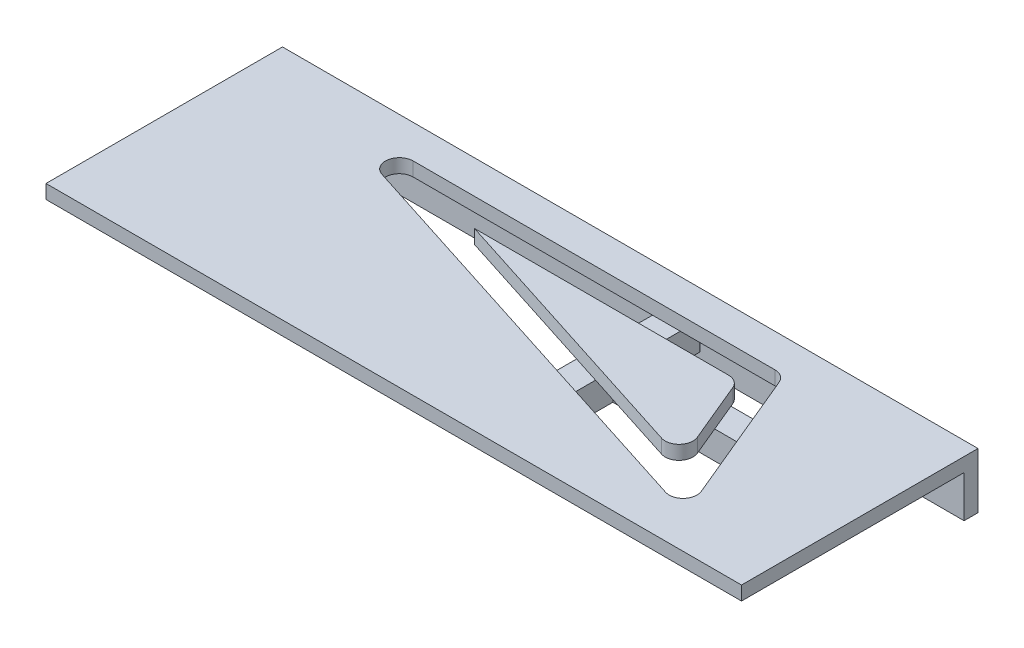
ISO-10303-21;
HEADER;
FILE_DESCRIPTION(('STEP AP214'),'2;1');
FILE_NAME('part.step','',(''),(''),'','','');
FILE_SCHEMA(('AUTOMOTIVE_DESIGN { 1 0 10303 214 1 1 1 1 }'));
ENDSEC;
DATA;
#1=APPLICATION_CONTEXT('core data for automotive mechanical design processes');
#2=APPLICATION_PROTOCOL_DEFINITION('international standard','automotive_design',2000,#1);
#3=PRODUCT_CONTEXT('',#1,'mechanical');
#4=PRODUCT('Part','Part','',(#3));
#5=PRODUCT_RELATED_PRODUCT_CATEGORY('part','',(#4));
#6=PRODUCT_DEFINITION_FORMATION('','',#4);
#7=PRODUCT_DEFINITION_CONTEXT('part definition',#1,'design');
#8=PRODUCT_DEFINITION('design','',#6,#7);
#9=PRODUCT_DEFINITION_SHAPE('','',#8);
#10=(LENGTH_UNIT() NAMED_UNIT(*) SI_UNIT(.MILLI.,.METRE.));
#11=(NAMED_UNIT(*) PLANE_ANGLE_UNIT() SI_UNIT($,.RADIAN.));
#12=(NAMED_UNIT(*) SI_UNIT($,.STERADIAN.) SOLID_ANGLE_UNIT());
#13=UNCERTAINTY_MEASURE_WITH_UNIT(LENGTH_MEASURE(1.E-05),#10,'distance_accuracy_value','');
#14=(GEOMETRIC_REPRESENTATION_CONTEXT(3) GLOBAL_UNCERTAINTY_ASSIGNED_CONTEXT((#13)) GLOBAL_UNIT_ASSIGNED_CONTEXT((#10,
#11,#12)) REPRESENTATION_CONTEXT('',''));
#15=CARTESIAN_POINT('',(0.,0.,0.));
#16=DIRECTION('',(0.,0.,1.));
#17=DIRECTION('',(1.,0.,0.));
#18=AXIS2_PLACEMENT_3D('',#15,#16,#17);
#19=CARTESIAN_POINT('',(0.,15.,85.));
#20=DIRECTION('',(0.,1.,0.));
#21=DIRECTION('',(0.,0.,1.));
#22=AXIS2_PLACEMENT_3D('',#19,#20,#21);
#23=PLANE('',#22);
#24=DIRECTION('',(1.,0.,0.));
#25=VECTOR('',#24,1.);
#26=CARTESIAN_POINT('',(182.333333333333,15.,22.));
#27=LINE('',#26,#25);
#28=CARTESIAN_POINT('',(91.0305059355084,15.,22.));
#29=VERTEX_POINT('',#28);
#30=CARTESIAN_POINT('',(145.,15.,22.));
#31=VERTEX_POINT('',#30);
#32=EDGE_CURVE('E275',#29,#31,#27,.T.);
#33=ORIENTED_EDGE('',*,*,#32,.T.);
#34=DIRECTION('',(0.,0.,-1.));
#35=VECTOR('',#34,1.);
#36=CARTESIAN_POINT('',(145.,15.,31.2449958123108));
#37=LINE('',#36,#35);
#38=CARTESIAN_POINT('',(145.,15.,39.2702381006373));
#39=VERTEX_POINT('',#38);
#40=EDGE_CURVE('E903',#39,#31,#37,.T.);
#41=ORIENTED_EDGE('',*,*,#40,.F.);
#42=DIRECTION('',(-0.952424147199324,0.,-0.304775727103784));
#43=VECTOR('',#42,1.);
#44=CARTESIAN_POINT('',(189.928273384325,15.,53.6472855836212));
#45=LINE('',#44,#43);
#46=EDGE_CURVE('E284',#39,#29,#45,.T.);
#47=ORIENTED_EDGE('',*,*,#46,.T.);
#48=EDGE_LOOP('',(#33,#41,#47));
#49=FACE_BOUND('',#48,.T.);
#50=ADVANCED_FACE('F35',(#49),#23,.F.);
#51=CARTESIAN_POINT('',(189.928273384325,15.,53.6472855836212));
#52=VERTEX_POINT('',#51);
#53=CARTESIAN_POINT('',(155.,15.,42.4702381006373));
#54=VERTEX_POINT('',#53);
#55=EDGE_CURVE('E285',#52,#54,#45,.T.);
#56=ORIENTED_EDGE('',*,*,#55,.T.);
#57=DIRECTION('',(0.,0.,1.));
#58=VECTOR('',#57,1.);
#59=CARTESIAN_POINT('',(155.,15.,36.2449958123108));
#60=LINE('',#59,#58);
#61=CARTESIAN_POINT('',(155.,15.,36.2449958123108));
#62=VERTEX_POINT('',#61);
#63=EDGE_CURVE('E376',#62,#54,#60,.T.);
#64=ORIENTED_EDGE('',*,*,#63,.F.);
#65=DIRECTION('',(-1.,0.,0.));
#66=VECTOR('',#65,1.);
#67=CARTESIAN_POINT('',(155.,15.,36.2449958123108));
#68=LINE('',#67,#66);
#69=CARTESIAN_POINT('',(191.602081588463,15.,36.2449958123108));
#70=VERTEX_POINT('',#69);
#71=EDGE_CURVE('E371',#70,#62,#68,.T.);
#72=ORIENTED_EDGE('',*,*,#71,.F.);
#73=DIRECTION('',(0.384615384615385,0.,0.923076923076923));
#74=VECTOR('',#73,1.);
#75=CARTESIAN_POINT('',(196.067536635228,15.,46.9620879245476));
#76=LINE('',#75,#74);
#77=CARTESIAN_POINT('',(196.067536635228,15.,46.9620879245476));
#78=VERTEX_POINT('',#77);
#79=EDGE_CURVE('E271',#70,#78,#76,.T.);
#80=ORIENTED_EDGE('',*,*,#79,.T.);
#81=CARTESIAN_POINT('',(191.452152019844,15.,48.8851648476246));
#82=DIRECTION('',(0.,-1.,0.));
#83=DIRECTION('',(0.,0.,1.));
#84=AXIS2_PLACEMENT_3D('',#81,#82,#83);
#85=CIRCLE('',#84,5.);
#86=EDGE_CURVE('E269',#78,#52,#85,.T.);
#87=ORIENTED_EDGE('',*,*,#86,.T.);
#88=EDGE_LOOP('',(#56,#64,#72,#80,#87));
#89=FACE_BOUND('',#88,.T.);
#90=ADVANCED_FACE('F582',(#89),#23,.F.);
#91=CARTESIAN_POINT('',(155.,15.,22.));
#92=VERTEX_POINT('',#91);
#93=CARTESIAN_POINT('',(182.333333333333,15.,22.));
#94=VERTEX_POINT('',#93);
#95=EDGE_CURVE('E274',#92,#94,#27,.T.);
#96=ORIENTED_EDGE('',*,*,#95,.T.);
#97=CARTESIAN_POINT('',(182.333333333333,15.,27.));
#98=DIRECTION('',(0.,-1.,0.));
#99=DIRECTION('',(0.,0.,-1.));
#100=AXIS2_PLACEMENT_3D('',#97,#98,#99);
#101=CIRCLE('',#100,4.99999999999999);
#102=CARTESIAN_POINT('',(186.948717948718,15.,25.0769230769231));
#103=VERTEX_POINT('',#102);
#104=EDGE_CURVE('E252',#94,#103,#101,.T.);
#105=ORIENTED_EDGE('',*,*,#104,.T.);
#106=CARTESIAN_POINT('',(187.435414921796,15.,26.2449958123108));
#107=VERTEX_POINT('',#106);
#108=EDGE_CURVE('E262',#103,#107,#76,.T.);
#109=ORIENTED_EDGE('',*,*,#108,.T.);
#110=DIRECTION('',(1.,0.,0.));
#111=VECTOR('',#110,1.);
#112=CARTESIAN_POINT('',(155.,15.,26.2449958123108));
#113=LINE('',#112,#111);
#114=CARTESIAN_POINT('',(155.,15.,26.2449958123108));
#115=VERTEX_POINT('',#114);
#116=EDGE_CURVE('E366',#115,#107,#113,.T.);
#117=ORIENTED_EDGE('',*,*,#116,.F.);
#118=DIRECTION('',(0.,0.,1.));
#119=VECTOR('',#118,1.);
#120=CARTESIAN_POINT('',(155.,15.,26.2449958123108));
#121=LINE('',#120,#119);
#122=EDGE_CURVE('E361',#92,#115,#121,.T.);
#123=ORIENTED_EDGE('',*,*,#122,.F.);
#124=EDGE_LOOP('',(#96,#105,#109,#117,#123));
#125=FACE_BOUND('',#124,.T.);
#126=ADVANCED_FACE('F272',(#125),#23,.F.);
#127=CARTESIAN_POINT('',(0.,0.,5.));
#128=DIRECTION('',(0.,0.,-1.));
#129=DIRECTION('',(-1.,0.,0.));
#130=AXIS2_PLACEMENT_3D('',#127,#128,#129);
#131=PLANE('',#130);
#132=DIRECTION('',(0.,1.,0.));
#133=VECTOR('',#132,1.);
#134=CARTESIAN_POINT('',(145.003192306434,5.,5.));
#135=LINE('',#134,#133);
#136=CARTESIAN_POINT('',(145.003192306434,15.,5.));
#137=VERTEX_POINT('',#136);
#138=CARTESIAN_POINT('',(145.003192306434,5.,5.));
#139=VERTEX_POINT('',#138);
#140=EDGE_CURVE('E412',#137,#139,#135,.F.);
#141=ORIENTED_EDGE('',*,*,#140,.F.);
#142=DIRECTION('',(1.,0.,0.));
#143=VECTOR('',#142,1.);
#144=CARTESIAN_POINT('',(0.,15.,5.));
#145=LINE('',#144,#143);
#146=CARTESIAN_POINT('',(0.,15.,5.));
#147=VERTEX_POINT('',#146);
#148=EDGE_CURVE('E420',#147,#137,#145,.T.);
#149=ORIENTED_EDGE('',*,*,#148,.F.);
#150=DIRECTION('',(0.,-1.,0.));
#151=VECTOR('',#150,1.);
#152=CARTESIAN_POINT('',(0.,0.,5.));
#153=LINE('',#152,#151);
#154=CARTESIAN_POINT('',(0.,0.,5.));
#155=VERTEX_POINT('',#154);
#156=EDGE_CURVE('E437',#147,#155,#153,.T.);
#157=ORIENTED_EDGE('',*,*,#156,.T.);
#158=DIRECTION('',(1.,0.,0.));
#159=VECTOR('',#158,1.);
#160=CARTESIAN_POINT('',(0.,0.,5.));
#161=LINE('',#160,#159);
#162=CARTESIAN_POINT('',(250.,0.,5.));
#163=VERTEX_POINT('',#162);
#164=EDGE_CURVE('E439',#155,#163,#161,.T.);
#165=ORIENTED_EDGE('',*,*,#164,.T.);
#166=DIRECTION('',(0.,1.,0.));
#167=VECTOR('',#166,1.);
#168=CARTESIAN_POINT('',(250.,0.,5.));
#169=LINE('',#168,#167);
#170=CARTESIAN_POINT('',(250.,15.,5.));
#171=VERTEX_POINT('',#170);
#172=EDGE_CURVE('E442',#163,#171,#169,.T.);
#173=ORIENTED_EDGE('',*,*,#172,.T.);
#174=CARTESIAN_POINT('',(154.996807693566,15.,5.));
#175=VERTEX_POINT('',#174);
#176=EDGE_CURVE('E415',#175,#171,#145,.T.);
#177=ORIENTED_EDGE('',*,*,#176,.F.);
#178=DIRECTION('',(0.,1.,0.));
#179=VECTOR('',#178,1.);
#180=CARTESIAN_POINT('',(154.996807693566,5.,5.));
#181=LINE('',#180,#179);
#182=CARTESIAN_POINT('',(154.996807693566,5.,5.));
#183=VERTEX_POINT('',#182);
#184=EDGE_CURVE('E409',#183,#175,#181,.T.);
#185=ORIENTED_EDGE('',*,*,#184,.F.);
#186=DIRECTION('',(-1.,0.,0.));
#187=VECTOR('',#186,1.);
#188=CARTESIAN_POINT('',(0.,5.,5.));
#189=LINE('',#188,#187);
#190=EDGE_CURVE('E467',#183,#139,#189,.T.);
#191=ORIENTED_EDGE('',*,*,#190,.T.);
#192=EDGE_LOOP('',(#141,#149,#157,#165,#173,#177,#185,#191));
#193=FACE_BOUND('',#192,.T.);
#194=ADVANCED_FACE('F546',(#193),#131,.F.);
#195=CARTESIAN_POINT('',(198.26874825513,15.,26.2449958123108));
#196=VERTEX_POINT('',#195);
#197=CARTESIAN_POINT('',(214.286235524828,15.,26.2449958123108));
#198=VERTEX_POINT('',#197);
#199=EDGE_CURVE('E365',#196,#198,#113,.T.);
#200=ORIENTED_EDGE('',*,*,#199,.F.);
#201=DIRECTION('',(0.384615384615384,0.,0.923076923076923));
#202=VECTOR('',#201,1.);
#203=CARTESIAN_POINT('',(213.615384615385,15.,63.076923076923));
#204=LINE('',#203,#202);
#205=CARTESIAN_POINT('',(193.615384615385,15.,15.0769230769231));
#206=VERTEX_POINT('',#205);
#207=EDGE_CURVE('E314',#206,#196,#204,.T.);
#208=ORIENTED_EDGE('',*,*,#207,.F.);
#209=CARTESIAN_POINT('',(189.,15.,17.));
#210=DIRECTION('',(0.,-1.,0.));
#211=DIRECTION('',(0.,0.,-1.));
#212=AXIS2_PLACEMENT_3D('',#209,#210,#211);
#213=CIRCLE('',#212,5.);
#214=CARTESIAN_POINT('',(189.,15.,12.));
#215=VERTEX_POINT('',#214);
#216=EDGE_CURVE('E309',#215,#206,#213,.T.);
#217=ORIENTED_EDGE('',*,*,#216,.F.);
#218=DIRECTION('',(1.,0.,0.));
#219=VECTOR('',#218,1.);
#220=CARTESIAN_POINT('',(189.,15.,12.));
#221=LINE('',#220,#219);
#222=CARTESIAN_POINT('',(155.,15.,12.));
#223=VERTEX_POINT('',#222);
#224=EDGE_CURVE('E305',#223,#215,#221,.T.);
#225=ORIENTED_EDGE('',*,*,#224,.F.);
#226=CARTESIAN_POINT('',(155.,15.,5.17864174628777));
#227=VERTEX_POINT('',#226);
#228=EDGE_CURVE('E362',#227,#223,#121,.T.);
#229=ORIENTED_EDGE('',*,*,#228,.F.);
#230=CARTESIAN_POINT('',(150.,15.,5.17864174628777));
#231=DIRECTION('',(0.,1.,0.));
#232=DIRECTION('',(0.,0.,1.));
#233=AXIS2_PLACEMENT_3D('',#230,#231,#232);
#234=CIRCLE('',#233,5.);
#235=EDGE_CURVE('E464',#175,#227,#234,.F.);
#236=ORIENTED_EDGE('',*,*,#235,.F.);
#237=ORIENTED_EDGE('',*,*,#176,.T.);
#238=DIRECTION('',(0.,0.,-1.));
#239=VECTOR('',#238,1.);
#240=CARTESIAN_POINT('',(250.,15.,85.));
#241=LINE('',#240,#239);
#242=CARTESIAN_POINT('',(250.,15.,85.));
#243=VERTEX_POINT('',#242);
#244=EDGE_CURVE('E428',#243,#171,#241,.T.);
#245=ORIENTED_EDGE('',*,*,#244,.F.);
#246=DIRECTION('',(1.,0.,0.));
#247=VECTOR('',#246,1.);
#248=CARTESIAN_POINT('',(0.,15.,85.));
#249=LINE('',#248,#247);
#250=CARTESIAN_POINT('',(0.,15.,85.));
#251=VERTEX_POINT('',#250);
#252=EDGE_CURVE('E419',#251,#243,#249,.T.);
#253=ORIENTED_EDGE('',*,*,#252,.F.);
#254=DIRECTION('',(0.,0.,-1.));
#255=VECTOR('',#254,1.);
#256=CARTESIAN_POINT('',(0.,15.,85.));
#257=LINE('',#256,#255);
#258=EDGE_CURVE('E433',#251,#147,#257,.T.);
#259=ORIENTED_EDGE('',*,*,#258,.T.);
#260=ORIENTED_EDGE('',*,*,#148,.T.);
#261=CARTESIAN_POINT('',(150.,15.,5.17864174628777));
#262=DIRECTION('',(0.,-1.,0.));
#263=DIRECTION('',(0.,0.,-1.));
#264=AXIS2_PLACEMENT_3D('',#261,#262,#263);
#265=CIRCLE('',#264,5.);
#266=CARTESIAN_POINT('',(145.,15.,5.17864174628777));
#267=VERTEX_POINT('',#266);
#268=EDGE_CURVE('E336',#267,#137,#265,.T.);
#269=ORIENTED_EDGE('',*,*,#268,.F.);
#270=CARTESIAN_POINT('',(145.,15.,12.));
#271=VERTEX_POINT('',#270);
#272=EDGE_CURVE('E382',#271,#267,#37,.T.);
#273=ORIENTED_EDGE('',*,*,#272,.F.);
#274=CARTESIAN_POINT('',(59.0000000000008,15.,12.));
#275=VERTEX_POINT('',#274);
#276=EDGE_CURVE('E306',#275,#271,#221,.T.);
#277=ORIENTED_EDGE('',*,*,#276,.F.);
#278=CARTESIAN_POINT('',(59.0000000000001,15.,17.));
#279=DIRECTION('',(0.,-1.,0.));
#280=DIRECTION('',(0.,0.,-1.));
#281=AXIS2_PLACEMENT_3D('',#278,#279,#280);
#282=CIRCLE('',#281,5.);
#283=CARTESIAN_POINT('',(57.4761213644818,15.,21.7621207359969));
#284=VERTEX_POINT('',#283);
#285=EDGE_CURVE('E301',#284,#275,#282,.T.);
#286=ORIENTED_EDGE('',*,*,#285,.F.);
#287=DIRECTION('',(-0.952424147199324,0.,-0.304775727103784));
#288=VECTOR('',#287,1.);
#289=CARTESIAN_POINT('',(207.476121364481,15.,69.7621207359966));
#290=LINE('',#289,#288);
#291=CARTESIAN_POINT('',(145.,15.,49.7697618993627));
#292=VERTEX_POINT('',#291);
#293=EDGE_CURVE('E298',#292,#284,#290,.T.);
#294=ORIENTED_EDGE('',*,*,#293,.F.);
#295=CARTESIAN_POINT('',(145.,15.,65.7198511899543));
#296=VERTEX_POINT('',#295);
#297=EDGE_CURVE('E341',#296,#292,#37,.T.);
#298=ORIENTED_EDGE('',*,*,#297,.F.);
#299=CARTESIAN_POINT('',(150.,15.,65.7198511899543));
#300=DIRECTION('',(0.,-1.,0.));
#301=DIRECTION('',(0.,0.,-1.));
#302=AXIS2_PLACEMENT_3D('',#299,#300,#301);
#303=CIRCLE('',#302,4.99999999999994);
#304=CARTESIAN_POINT('',(155.,15.,65.7198511899543));
#305=VERTEX_POINT('',#304);
#306=EDGE_CURVE('E379',#305,#296,#303,.T.);
#307=ORIENTED_EDGE('',*,*,#306,.F.);
#308=CARTESIAN_POINT('',(155.,15.,52.9697618993626));
#309=VERTEX_POINT('',#308);
#310=EDGE_CURVE('E375',#309,#305,#60,.T.);
#311=ORIENTED_EDGE('',*,*,#310,.F.);
#312=CARTESIAN_POINT('',(207.476121364481,15.,69.7621207359966));
#313=VERTEX_POINT('',#312);
#314=EDGE_CURVE('E299',#313,#309,#290,.T.);
#315=ORIENTED_EDGE('',*,*,#314,.F.);
#316=CARTESIAN_POINT('',(209.,15.,65.));
#317=DIRECTION('',(0.,-1.,0.));
#318=DIRECTION('',(0.,0.,1.));
#319=AXIS2_PLACEMENT_3D('',#316,#317,#318);
#320=CIRCLE('',#319,5.);
#321=CARTESIAN_POINT('',(213.615384615385,15.,63.076923076923));
#322=VERTEX_POINT('',#321);
#323=EDGE_CURVE('E291',#322,#313,#320,.T.);
#324=ORIENTED_EDGE('',*,*,#323,.F.);
#325=CARTESIAN_POINT('',(202.435414921796,15.,36.2449958123108));
#326=VERTEX_POINT('',#325);
#327=EDGE_CURVE('E313',#326,#322,#204,.T.);
#328=ORIENTED_EDGE('',*,*,#327,.F.);
#329=CARTESIAN_POINT('',(214.286235524828,15.,36.2449958123108));
#330=VERTEX_POINT('',#329);
#331=EDGE_CURVE('E372',#330,#326,#68,.T.);
#332=ORIENTED_EDGE('',*,*,#331,.F.);
#333=CARTESIAN_POINT('',(214.286235524828,15.,31.2449958123108));
#334=DIRECTION('',(0.,-1.,0.));
#335=DIRECTION('',(0.,0.,-1.));
#336=AXIS2_PLACEMENT_3D('',#333,#334,#335);
#337=CIRCLE('',#336,5.);
#338=EDGE_CURVE('E368',#198,#330,#337,.T.);
#339=ORIENTED_EDGE('',*,*,#338,.F.);
#340=EDGE_LOOP('',(#200,#208,#217,#225,#229,#236,#237,#245,#253,#259,#260,#269,#273,#277,#286,
#294,#298,#307,#311,#315,#324,#328,#332,#339));
#341=FACE_BOUND('',#340,.T.);
#342=ADVANCED_FACE('F507',(#341),#23,.F.);
#343=CARTESIAN_POINT('',(0.,0.,5.));
#344=DIRECTION('',(1.,0.,0.));
#345=DIRECTION('',(0.,0.,-1.));
#346=AXIS2_PLACEMENT_3D('',#343,#344,#345);
#347=PLANE('',#346);
#348=DIRECTION('',(0.,-1.,0.));
#349=VECTOR('',#348,1.);
#350=CARTESIAN_POINT('',(0.,0.,0.));
#351=LINE('',#350,#349);
#352=CARTESIAN_POINT('',(0.,20.,0.));
#353=VERTEX_POINT('',#352);
#354=CARTESIAN_POINT('',(0.,0.,0.));
#355=VERTEX_POINT('',#354);
#356=EDGE_CURVE('E436',#353,#355,#351,.T.);
#357=ORIENTED_EDGE('',*,*,#356,.T.);
#358=DIRECTION('',(0.,0.,-1.));
#359=VECTOR('',#358,1.);
#360=CARTESIAN_POINT('',(0.,0.,5.));
#361=LINE('',#360,#359);
#362=EDGE_CURVE('E461',#155,#355,#361,.T.);
#363=ORIENTED_EDGE('',*,*,#362,.F.);
#364=ORIENTED_EDGE('',*,*,#156,.F.);
#365=ORIENTED_EDGE('',*,*,#258,.F.);
#366=DIRECTION('',(0.,-1.,0.));
#367=VECTOR('',#366,1.);
#368=CARTESIAN_POINT('',(0.,20.,85.));
#369=LINE('',#368,#367);
#370=CARTESIAN_POINT('',(0.,20.,85.));
#371=VERTEX_POINT('',#370);
#372=EDGE_CURVE('E416',#371,#251,#369,.T.);
#373=ORIENTED_EDGE('',*,*,#372,.F.);
#374=DIRECTION('',(0.,0.,-1.));
#375=VECTOR('',#374,1.);
#376=CARTESIAN_POINT('',(0.,20.,5.));
#377=LINE('',#376,#375);
#378=EDGE_CURVE('E445',#371,#353,#377,.T.);
#379=ORIENTED_EDGE('',*,*,#378,.T.);
#380=EDGE_LOOP('',(#357,#363,#364,#365,#373,#379));
#381=FACE_BOUND('',#380,.T.);
#382=ADVANCED_FACE('F37',(#381),#347,.F.);
#383=CARTESIAN_POINT('',(0.,0.,5.));
#384=DIRECTION('',(0.,1.,0.));
#385=DIRECTION('',(0.,0.,1.));
#386=AXIS2_PLACEMENT_3D('',#383,#384,#385);
#387=PLANE('',#386);
#388=DIRECTION('',(1.,0.,0.));
#389=VECTOR('',#388,1.);
#390=CARTESIAN_POINT('',(0.,0.,0.));
#391=LINE('',#390,#389);
#392=CARTESIAN_POINT('',(250.,0.,0.));
#393=VERTEX_POINT('',#392);
#394=EDGE_CURVE('E448',#355,#393,#391,.T.);
#395=ORIENTED_EDGE('',*,*,#394,.T.);
#396=DIRECTION('',(0.,0.,-1.));
#397=VECTOR('',#396,1.);
#398=CARTESIAN_POINT('',(250.,0.,5.));
#399=LINE('',#398,#397);
#400=EDGE_CURVE('E458',#163,#393,#399,.T.);
#401=ORIENTED_EDGE('',*,*,#400,.F.);
#402=ORIENTED_EDGE('',*,*,#164,.F.);
#403=ORIENTED_EDGE('',*,*,#362,.T.);
#404=EDGE_LOOP('',(#395,#401,#402,#403));
#405=FACE_BOUND('',#404,.T.);
#406=ADVANCED_FACE('F563',(#405),#387,.F.);
#407=CARTESIAN_POINT('',(250.,0.,5.));
#408=DIRECTION('',(-1.,0.,0.));
#409=DIRECTION('',(0.,0.,1.));
#410=AXIS2_PLACEMENT_3D('',#407,#408,#409);
#411=PLANE('',#410);
#412=DIRECTION('',(0.,1.,0.));
#413=VECTOR('',#412,1.);
#414=CARTESIAN_POINT('',(250.,0.,0.));
#415=LINE('',#414,#413);
#416=CARTESIAN_POINT('',(250.,20.,0.));
#417=VERTEX_POINT('',#416);
#418=EDGE_CURVE('E450',#393,#417,#415,.T.);
#419=ORIENTED_EDGE('',*,*,#418,.T.);
#420=DIRECTION('',(0.,0.,-1.));
#421=VECTOR('',#420,1.);
#422=CARTESIAN_POINT('',(250.,20.,5.));
#423=LINE('',#422,#421);
#424=CARTESIAN_POINT('',(250.,20.,85.));
#425=VERTEX_POINT('',#424);
#426=EDGE_CURVE('E455',#425,#417,#423,.T.);
#427=ORIENTED_EDGE('',*,*,#426,.F.);
#428=DIRECTION('',(0.,1.,0.));
#429=VECTOR('',#428,1.);
#430=CARTESIAN_POINT('',(250.,20.,85.));
#431=LINE('',#430,#429);
#432=EDGE_CURVE('E422',#243,#425,#431,.T.);
#433=ORIENTED_EDGE('',*,*,#432,.F.);
#434=ORIENTED_EDGE('',*,*,#244,.T.);
#435=ORIENTED_EDGE('',*,*,#172,.F.);
#436=ORIENTED_EDGE('',*,*,#400,.T.);
#437=EDGE_LOOP('',(#419,#427,#433,#434,#435,#436));
#438=FACE_BOUND('',#437,.T.);
#439=ADVANCED_FACE('F553',(#438),#411,.F.);
#440=CARTESIAN_POINT('',(0.,20.,5.));
#441=DIRECTION('',(0.,-1.,0.));
#442=DIRECTION('',(0.,0.,-1.));
#443=AXIS2_PLACEMENT_3D('',#440,#441,#442);
#444=PLANE('',#443);
#445=DIRECTION('',(0.384615384615384,0.,0.923076923076923));
#446=VECTOR('',#445,1.);
#447=CARTESIAN_POINT('',(161.396449704142,20.,-62.2485207100592));
#448=LINE('',#447,#446);
#449=CARTESIAN_POINT('',(193.615384615385,20.,15.0769230769231));
#450=VERTEX_POINT('',#449);
#451=CARTESIAN_POINT('',(213.615384615385,20.,63.076923076923));
#452=VERTEX_POINT('',#451);
#453=EDGE_CURVE('E43',#450,#452,#448,.T.);
#454=ORIENTED_EDGE('',*,*,#453,.T.);
#455=CARTESIAN_POINT('',(209.,20.,65.));
#456=DIRECTION('',(0.,-1.,0.));
#457=DIRECTION('',(0.,0.,-1.));
#458=AXIS2_PLACEMENT_3D('',#455,#456,#457);
#459=CIRCLE('',#458,5.);
#460=CARTESIAN_POINT('',(207.476121364481,20.,69.7621207359966));
#461=VERTEX_POINT('',#460);
#462=EDGE_CURVE('E11',#452,#461,#459,.T.);
#463=ORIENTED_EDGE('',*,*,#462,.T.);
#464=DIRECTION('',(-0.952424147199324,0.,-0.304775727103784));
#465=VECTOR('',#464,1.);
#466=CARTESIAN_POINT('',(0.473218606861348,20.,3.52119185355829));
#467=LINE('',#466,#465);
#468=CARTESIAN_POINT('',(57.4761213644818,20.,21.7621207359968));
#469=VERTEX_POINT('',#468);
#470=EDGE_CURVE('E478',#461,#469,#467,.T.);
#471=ORIENTED_EDGE('',*,*,#470,.T.);
#472=CARTESIAN_POINT('',(59.0000000000001,20.,17.));
#473=DIRECTION('',(0.,-1.,0.));
#474=DIRECTION('',(0.,0.,-1.));
#475=AXIS2_PLACEMENT_3D('',#472,#473,#474);
#476=CIRCLE('',#475,5.);
#477=CARTESIAN_POINT('',(59.0000000000008,20.,12.));
#478=VERTEX_POINT('',#477);
#479=EDGE_CURVE('E481',#469,#478,#476,.T.);
#480=ORIENTED_EDGE('',*,*,#479,.T.);
#481=DIRECTION('',(1.,0.,0.));
#482=VECTOR('',#481,1.);
#483=CARTESIAN_POINT('',(0.,20.,12.));
#484=LINE('',#483,#482);
#485=CARTESIAN_POINT('',(189.,20.,12.));
#486=VERTEX_POINT('',#485);
#487=EDGE_CURVE('E484',#478,#486,#484,.T.);
#488=ORIENTED_EDGE('',*,*,#487,.T.);
#489=CARTESIAN_POINT('',(189.,20.,17.));
#490=DIRECTION('',(0.,-1.,0.));
#491=DIRECTION('',(0.,0.,-1.));
#492=AXIS2_PLACEMENT_3D('',#489,#490,#491);
#493=CIRCLE('',#492,5.);
#494=EDGE_CURVE('E487',#486,#450,#493,.T.);
#495=ORIENTED_EDGE('',*,*,#494,.T.);
#496=EDGE_LOOP('',(#454,#463,#471,#480,#488,#495));
#497=FACE_BOUND('',#496,.T.);
#498=DIRECTION('',(-1.,0.,0.));
#499=VECTOR('',#498,1.);
#500=CARTESIAN_POINT('',(0.,20.,0.));
#501=LINE('',#500,#499);
#502=EDGE_CURVE('E440',#417,#353,#501,.T.);
#503=ORIENTED_EDGE('',*,*,#502,.T.);
#504=ORIENTED_EDGE('',*,*,#378,.F.);
#505=DIRECTION('',(-1.,0.,0.));
#506=VECTOR('',#505,1.);
#507=CARTESIAN_POINT('',(0.,20.,85.));
#508=LINE('',#507,#506);
#509=EDGE_CURVE('E425',#425,#371,#508,.T.);
#510=ORIENTED_EDGE('',*,*,#509,.F.);
#511=ORIENTED_EDGE('',*,*,#426,.T.);
#512=EDGE_LOOP('',(#503,#504,#510,#511));
#513=FACE_BOUND('',#512,.T.);
#514=ADVANCED_FACE('F491',(#497,#513),#444,.F.);
#515=CARTESIAN_POINT('',(0.,0.,0.));
#516=DIRECTION('',(0.,0.,-1.));
#517=DIRECTION('',(-1.,0.,0.));
#518=AXIS2_PLACEMENT_3D('',#515,#516,#517);
#519=PLANE('',#518);
#520=ORIENTED_EDGE('',*,*,#356,.F.);
#521=ORIENTED_EDGE('',*,*,#502,.F.);
#522=ORIENTED_EDGE('',*,*,#418,.F.);
#523=ORIENTED_EDGE('',*,*,#394,.F.);
#524=EDGE_LOOP('',(#520,#521,#522,#523));
#525=FACE_BOUND('',#524,.T.);
#526=ADVANCED_FACE('F568',(#525),#519,.T.);
#527=CARTESIAN_POINT('',(0.,0.,85.));
#528=DIRECTION('',(0.,0.,1.));
#529=DIRECTION('',(1.,0.,0.));
#530=AXIS2_PLACEMENT_3D('',#527,#528,#529);
#531=PLANE('',#530);
#532=ORIENTED_EDGE('',*,*,#372,.T.);
#533=ORIENTED_EDGE('',*,*,#252,.T.);
#534=ORIENTED_EDGE('',*,*,#432,.T.);
#535=ORIENTED_EDGE('',*,*,#509,.T.);
#536=EDGE_LOOP('',(#532,#533,#534,#535));
#537=FACE_BOUND('',#536,.T.);
#538=ADVANCED_FACE('F557',(#537),#531,.T.);
#539=CARTESIAN_POINT('',(150.,5.,5.17864174628777));
#540=DIRECTION('',(0.,-1.,0.));
#541=DIRECTION('',(0.,0.,-1.));
#542=AXIS2_PLACEMENT_3D('',#539,#540,#541);
#543=PLANE('',#542);
#544=ORIENTED_EDGE('',*,*,#190,.F.);
#545=CARTESIAN_POINT('',(150.,5.,5.17864174628777));
#546=DIRECTION('',(0.,-1.,0.));
#547=DIRECTION('',(0.,0.,-1.));
#548=AXIS2_PLACEMENT_3D('',#545,#546,#547);
#549=CIRCLE('',#548,5.);
#550=CARTESIAN_POINT('',(155.,5.,5.17864174628777));
#551=VERTEX_POINT('',#550);
#552=EDGE_CURVE('E340',#183,#551,#549,.T.);
#553=ORIENTED_EDGE('',*,*,#552,.T.);
#554=DIRECTION('',(0.,0.,1.));
#555=VECTOR('',#554,1.);
#556=CARTESIAN_POINT('',(155.,5.,26.2449958123108));
#557=LINE('',#556,#555);
#558=CARTESIAN_POINT('',(155.,5.,26.2449958123108));
#559=VERTEX_POINT('',#558);
#560=EDGE_CURVE('E345',#551,#559,#557,.T.);
#561=ORIENTED_EDGE('',*,*,#560,.T.);
#562=DIRECTION('',(1.,0.,0.));
#563=VECTOR('',#562,1.);
#564=CARTESIAN_POINT('',(155.,5.,26.2449958123108));
#565=LINE('',#564,#563);
#566=CARTESIAN_POINT('',(214.286235524828,5.,26.2449958123108));
#567=VERTEX_POINT('',#566);
#568=EDGE_CURVE('E347',#559,#567,#565,.T.);
#569=ORIENTED_EDGE('',*,*,#568,.T.);
#570=CARTESIAN_POINT('',(214.286235524828,5.,31.2449958123108));
#571=DIRECTION('',(0.,-1.,0.));
#572=DIRECTION('',(0.,0.,-1.));
#573=AXIS2_PLACEMENT_3D('',#570,#571,#572);
#574=CIRCLE('',#573,5.);
#575=CARTESIAN_POINT('',(214.286235524828,5.,36.2449958123108));
#576=VERTEX_POINT('',#575);
#577=EDGE_CURVE('E349',#567,#576,#574,.T.);
#578=ORIENTED_EDGE('',*,*,#577,.T.);
#579=DIRECTION('',(-1.,0.,0.));
#580=VECTOR('',#579,1.);
#581=CARTESIAN_POINT('',(155.,5.,36.2449958123108));
#582=LINE('',#581,#580);
#583=CARTESIAN_POINT('',(155.,5.,36.2449958123108));
#584=VERTEX_POINT('',#583);
#585=EDGE_CURVE('E351',#576,#584,#582,.T.);
#586=ORIENTED_EDGE('',*,*,#585,.T.);
#587=DIRECTION('',(0.,0.,1.));
#588=VECTOR('',#587,1.);
#589=CARTESIAN_POINT('',(155.,5.,36.2449958123108));
#590=LINE('',#589,#588);
#591=CARTESIAN_POINT('',(155.,5.,65.7198511899543));
#592=VERTEX_POINT('',#591);
#593=EDGE_CURVE('E353',#584,#592,#590,.T.);
#594=ORIENTED_EDGE('',*,*,#593,.T.);
#595=CARTESIAN_POINT('',(150.,5.,65.7198511899543));
#596=DIRECTION('',(0.,-1.,0.));
#597=DIRECTION('',(0.,0.,-1.));
#598=AXIS2_PLACEMENT_3D('',#595,#596,#597);
#599=CIRCLE('',#598,4.99999999999994);
#600=CARTESIAN_POINT('',(145.,5.,65.7198511899543));
#601=VERTEX_POINT('',#600);
#602=EDGE_CURVE('E355',#592,#601,#599,.T.);
#603=ORIENTED_EDGE('',*,*,#602,.T.);
#604=DIRECTION('',(0.,0.,-1.));
#605=VECTOR('',#604,1.);
#606=CARTESIAN_POINT('',(145.,5.,31.2449958123108));
#607=LINE('',#606,#605);
#608=CARTESIAN_POINT('',(145.,5.,5.17864174628777));
#609=VERTEX_POINT('',#608);
#610=EDGE_CURVE('E337',#601,#609,#607,.T.);
#611=ORIENTED_EDGE('',*,*,#610,.T.);
#612=EDGE_CURVE('E342',#609,#139,#549,.T.);
#613=ORIENTED_EDGE('',*,*,#612,.T.);
#614=EDGE_LOOP('',(#544,#553,#561,#569,#578,#586,#594,#603,#611,#613));
#615=FACE_BOUND('',#614,.T.);
#616=ADVANCED_FACE('F617',(#615),#543,.T.);
#617=CARTESIAN_POINT('',(150.,5.,5.17864174628777));
#618=DIRECTION('',(0.,1.,0.));
#619=DIRECTION('',(0.,0.,1.));
#620=AXIS2_PLACEMENT_3D('',#617,#618,#619);
#621=CYLINDRICAL_SURFACE('',#620,5.);
#622=ORIENTED_EDGE('',*,*,#268,.T.);
#623=ORIENTED_EDGE('',*,*,#140,.T.);
#624=ORIENTED_EDGE('',*,*,#612,.F.);
#625=DIRECTION('',(0.,1.,0.));
#626=VECTOR('',#625,1.);
#627=CARTESIAN_POINT('',(145.,5.,5.17864174628777));
#628=LINE('',#627,#626);
#629=EDGE_CURVE('E406',#609,#267,#628,.T.);
#630=ORIENTED_EDGE('',*,*,#629,.T.);
#631=EDGE_LOOP('',(#622,#623,#624,#630));
#632=FACE_BOUND('',#631,.T.);
#633=ADVANCED_FACE('F621',(#632),#621,.T.);
#634=ORIENTED_EDGE('',*,*,#552,.F.);
#635=ORIENTED_EDGE('',*,*,#184,.T.);
#636=ORIENTED_EDGE('',*,*,#235,.T.);
#637=DIRECTION('',(0.,1.,0.));
#638=VECTOR('',#637,1.);
#639=CARTESIAN_POINT('',(155.,5.,5.17864174628777));
#640=LINE('',#639,#638);
#641=EDGE_CURVE('E403',#551,#227,#640,.T.);
#642=ORIENTED_EDGE('',*,*,#641,.F.);
#643=EDGE_LOOP('',(#634,#635,#636,#642));
#644=FACE_BOUND('',#643,.T.);
#645=ADVANCED_FACE('F542',(#644),#621,.T.);
#646=CARTESIAN_POINT('',(155.,5.,26.2449958123108));
#647=DIRECTION('',(-1.,0.,0.));
#648=DIRECTION('',(0.,0.,1.));
#649=AXIS2_PLACEMENT_3D('',#646,#647,#648);
#650=PLANE('',#649);
#651=ORIENTED_EDGE('',*,*,#228,.T.);
#652=DIRECTION('',(0.,0.,-1.));
#653=VECTOR('',#652,1.);
#654=CARTESIAN_POINT('',(155.,15.,26.2449958123108));
#655=LINE('',#654,#653);
#656=EDGE_CURVE('E334',#92,#223,#655,.T.);
#657=ORIENTED_EDGE('',*,*,#656,.F.);
#658=ORIENTED_EDGE('',*,*,#122,.T.);
#659=DIRECTION('',(0.,1.,0.));
#660=VECTOR('',#659,1.);
#661=CARTESIAN_POINT('',(155.,5.,26.2449958123108));
#662=LINE('',#661,#660);
#663=EDGE_CURVE('E400',#559,#115,#662,.T.);
#664=ORIENTED_EDGE('',*,*,#663,.F.);
#665=ORIENTED_EDGE('',*,*,#560,.F.);
#666=ORIENTED_EDGE('',*,*,#641,.T.);
#667=EDGE_LOOP('',(#651,#657,#658,#664,#665,#666));
#668=FACE_BOUND('',#667,.T.);
#669=ADVANCED_FACE('F536',(#668),#650,.F.);
#670=CARTESIAN_POINT('',(155.,5.,26.2449958123108));
#671=DIRECTION('',(0.,0.,1.));
#672=DIRECTION('',(1.,0.,0.));
#673=AXIS2_PLACEMENT_3D('',#670,#671,#672);
#674=PLANE('',#673);
#675=ORIENTED_EDGE('',*,*,#116,.T.);
#676=DIRECTION('',(-1.,0.,0.));
#677=VECTOR('',#676,1.);
#678=CARTESIAN_POINT('',(155.,15.,26.2449958123108));
#679=LINE('',#678,#677);
#680=EDGE_CURVE('E332',#196,#107,#679,.T.);
#681=ORIENTED_EDGE('',*,*,#680,.F.);
#682=ORIENTED_EDGE('',*,*,#199,.T.);
#683=DIRECTION('',(0.,1.,0.));
#684=VECTOR('',#683,1.);
#685=CARTESIAN_POINT('',(214.286235524828,5.,26.2449958123108));
#686=LINE('',#685,#684);
#687=EDGE_CURVE('E397',#567,#198,#686,.T.);
#688=ORIENTED_EDGE('',*,*,#687,.F.);
#689=ORIENTED_EDGE('',*,*,#568,.F.);
#690=ORIENTED_EDGE('',*,*,#663,.T.);
#691=EDGE_LOOP('',(#675,#681,#682,#688,#689,#690));
#692=FACE_BOUND('',#691,.T.);
#693=ADVANCED_FACE('F651',(#692),#674,.F.);
#694=CARTESIAN_POINT('',(214.286235524828,5.,31.2449958123108));
#695=DIRECTION('',(0.,1.,0.));
#696=DIRECTION('',(0.,0.,1.));
#697=AXIS2_PLACEMENT_3D('',#694,#695,#696);
#698=CYLINDRICAL_SURFACE('',#697,5.);
#699=ORIENTED_EDGE('',*,*,#338,.T.);
#700=DIRECTION('',(0.,1.,0.));
#701=VECTOR('',#700,1.);
#702=CARTESIAN_POINT('',(214.286235524828,5.,36.2449958123108));
#703=LINE('',#702,#701);
#704=EDGE_CURVE('E394',#576,#330,#703,.T.);
#705=ORIENTED_EDGE('',*,*,#704,.F.);
#706=ORIENTED_EDGE('',*,*,#577,.F.);
#707=ORIENTED_EDGE('',*,*,#687,.T.);
#708=EDGE_LOOP('',(#699,#705,#706,#707));
#709=FACE_BOUND('',#708,.T.);
#710=ADVANCED_FACE('F645',(#709),#698,.T.);
#711=CARTESIAN_POINT('',(155.,5.,36.2449958123108));
#712=DIRECTION('',(0.,0.,-1.));
#713=DIRECTION('',(-1.,0.,0.));
#714=AXIS2_PLACEMENT_3D('',#711,#712,#713);
#715=PLANE('',#714);
#716=ORIENTED_EDGE('',*,*,#331,.T.);
#717=DIRECTION('',(1.,0.,0.));
#718=VECTOR('',#717,1.);
#719=CARTESIAN_POINT('',(155.,15.,36.2449958123108));
#720=LINE('',#719,#718);
#721=EDGE_CURVE('E330',#70,#326,#720,.T.);
#722=ORIENTED_EDGE('',*,*,#721,.F.);
#723=ORIENTED_EDGE('',*,*,#71,.T.);
#724=DIRECTION('',(0.,1.,0.));
#725=VECTOR('',#724,1.);
#726=CARTESIAN_POINT('',(155.,5.,36.2449958123108));
#727=LINE('',#726,#725);
#728=EDGE_CURVE('E391',#584,#62,#727,.T.);
#729=ORIENTED_EDGE('',*,*,#728,.F.);
#730=ORIENTED_EDGE('',*,*,#585,.F.);
#731=ORIENTED_EDGE('',*,*,#704,.T.);
#732=EDGE_LOOP('',(#716,#722,#723,#729,#730,#731));
#733=FACE_BOUND('',#732,.T.);
#734=ADVANCED_FACE('F650',(#733),#715,.F.);
#735=CARTESIAN_POINT('',(155.,5.,36.2449958123108));
#736=DIRECTION('',(-1.,0.,0.));
#737=DIRECTION('',(0.,0.,1.));
#738=AXIS2_PLACEMENT_3D('',#735,#736,#737);
#739=PLANE('',#738);
#740=ORIENTED_EDGE('',*,*,#63,.T.);
#741=DIRECTION('',(0.,0.,-1.));
#742=VECTOR('',#741,1.);
#743=CARTESIAN_POINT('',(155.,15.,36.2449958123108));
#744=LINE('',#743,#742);
#745=EDGE_CURVE('E320',#309,#54,#744,.T.);
#746=ORIENTED_EDGE('',*,*,#745,.F.);
#747=ORIENTED_EDGE('',*,*,#310,.T.);
#748=DIRECTION('',(0.,1.,0.));
#749=VECTOR('',#748,1.);
#750=CARTESIAN_POINT('',(155.,5.,65.7198511899543));
#751=LINE('',#750,#749);
#752=EDGE_CURVE('E388',#592,#305,#751,.T.);
#753=ORIENTED_EDGE('',*,*,#752,.F.);
#754=ORIENTED_EDGE('',*,*,#593,.F.);
#755=ORIENTED_EDGE('',*,*,#728,.T.);
#756=EDGE_LOOP('',(#740,#746,#747,#753,#754,#755));
#757=FACE_BOUND('',#756,.T.);
#758=ADVANCED_FACE('F666',(#757),#739,.F.);
#759=CARTESIAN_POINT('',(150.,5.,65.7198511899543));
#760=DIRECTION('',(0.,1.,0.));
#761=DIRECTION('',(0.,0.,1.));
#762=AXIS2_PLACEMENT_3D('',#759,#760,#761);
#763=CYLINDRICAL_SURFACE('',#762,4.99999999999994);
#764=ORIENTED_EDGE('',*,*,#306,.T.);
#765=DIRECTION('',(0.,1.,0.));
#766=VECTOR('',#765,1.);
#767=CARTESIAN_POINT('',(145.,5.,65.7198511899543));
#768=LINE('',#767,#766);
#769=EDGE_CURVE('E358',#601,#296,#768,.T.);
#770=ORIENTED_EDGE('',*,*,#769,.F.);
#771=ORIENTED_EDGE('',*,*,#602,.F.);
#772=ORIENTED_EDGE('',*,*,#752,.T.);
#773=EDGE_LOOP('',(#764,#770,#771,#772));
#774=FACE_BOUND('',#773,.T.);
#775=ADVANCED_FACE('F661',(#774),#763,.T.);
#776=CARTESIAN_POINT('',(145.,5.,31.2449958123108));
#777=DIRECTION('',(1.,0.,0.));
#778=DIRECTION('',(0.,0.,-1.));
#779=AXIS2_PLACEMENT_3D('',#776,#777,#778);
#780=PLANE('',#779);
#781=ORIENTED_EDGE('',*,*,#297,.T.);
#782=EDGE_CURVE('E385',#292,#39,#37,.T.);
#783=ORIENTED_EDGE('',*,*,#782,.T.);
#784=ORIENTED_EDGE('',*,*,#40,.T.);
#785=EDGE_CURVE('E899',#31,#271,#37,.T.);
#786=ORIENTED_EDGE('',*,*,#785,.T.);
#787=ORIENTED_EDGE('',*,*,#272,.T.);
#788=ORIENTED_EDGE('',*,*,#629,.F.);
#789=ORIENTED_EDGE('',*,*,#610,.F.);
#790=ORIENTED_EDGE('',*,*,#769,.T.);
#791=EDGE_LOOP('',(#781,#783,#784,#786,#787,#788,#789,#790));
#792=FACE_BOUND('',#791,.T.);
#793=ADVANCED_FACE('F665',(#792),#780,.F.);
#794=CARTESIAN_POINT('',(209.,25.,65.));
#795=DIRECTION('',(0.,-1.,0.));
#796=DIRECTION('',(0.,0.,-1.));
#797=AXIS2_PLACEMENT_3D('',#794,#795,#796);
#798=CYLINDRICAL_SURFACE('',#797,5.);
#799=DIRECTION('',(0.,-1.,0.));
#800=VECTOR('',#799,1.);
#801=CARTESIAN_POINT('',(213.615384615385,25.,63.076923076923));
#802=LINE('',#801,#800);
#803=EDGE_CURVE('E318',#452,#322,#802,.T.);
#804=ORIENTED_EDGE('',*,*,#803,.T.);
#805=ORIENTED_EDGE('',*,*,#323,.T.);
#806=DIRECTION('',(0.,-1.,0.));
#807=VECTOR('',#806,1.);
#808=CARTESIAN_POINT('',(207.476121364481,25.,69.7621207359966));
#809=LINE('',#808,#807);
#810=EDGE_CURVE('E316',#461,#313,#809,.T.);
#811=ORIENTED_EDGE('',*,*,#810,.F.);
#812=ORIENTED_EDGE('',*,*,#462,.F.);
#813=EDGE_LOOP('',(#804,#805,#811,#812));
#814=FACE_BOUND('',#813,.T.);
#815=ADVANCED_FACE('F521',(#814),#798,.F.);
#816=CARTESIAN_POINT('',(213.615384615385,25.,63.076923076923));
#817=DIRECTION('',(0.923076923076923,0.,-0.384615384615384));
#818=DIRECTION('',(-0.384615384615384,0.,-0.923076923076923));
#819=AXIS2_PLACEMENT_3D('',#816,#817,#818);
#820=PLANE('',#819);
#821=DIRECTION('',(0.,-1.,0.));
#822=VECTOR('',#821,1.);
#823=CARTESIAN_POINT('',(193.615384615385,25.,15.0769230769231));
#824=LINE('',#823,#822);
#825=EDGE_CURVE('E321',#450,#206,#824,.T.);
#826=ORIENTED_EDGE('',*,*,#825,.T.);
#827=ORIENTED_EDGE('',*,*,#207,.T.);
#828=EDGE_CURVE('E317',#196,#326,#204,.T.);
#829=ORIENTED_EDGE('',*,*,#828,.T.);
#830=ORIENTED_EDGE('',*,*,#327,.T.);
#831=ORIENTED_EDGE('',*,*,#803,.F.);
#832=ORIENTED_EDGE('',*,*,#453,.F.);
#833=EDGE_LOOP('',(#826,#827,#829,#830,#831,#832));
#834=FACE_BOUND('',#833,.T.);
#835=ADVANCED_FACE('F496',(#834),#820,.F.);
#836=CARTESIAN_POINT('',(189.,25.,17.));
#837=DIRECTION('',(0.,-1.,0.));
#838=DIRECTION('',(0.,0.,-1.));
#839=AXIS2_PLACEMENT_3D('',#836,#837,#838);
#840=CYLINDRICAL_SURFACE('',#839,5.);
#841=DIRECTION('',(0.,-1.,0.));
#842=VECTOR('',#841,1.);
#843=CARTESIAN_POINT('',(189.,25.,12.));
#844=LINE('',#843,#842);
#845=EDGE_CURVE('E323',#486,#215,#844,.T.);
#846=ORIENTED_EDGE('',*,*,#845,.T.);
#847=ORIENTED_EDGE('',*,*,#216,.T.);
#848=ORIENTED_EDGE('',*,*,#825,.F.);
#849=ORIENTED_EDGE('',*,*,#494,.F.);
#850=EDGE_LOOP('',(#846,#847,#848,#849));
#851=FACE_BOUND('',#850,.T.);
#852=ADVANCED_FACE('F499',(#851),#840,.F.);
#853=CARTESIAN_POINT('',(189.,25.,12.));
#854=DIRECTION('',(0.,0.,-1.));
#855=DIRECTION('',(-1.,0.,0.));
#856=AXIS2_PLACEMENT_3D('',#853,#854,#855);
#857=PLANE('',#856);
#858=DIRECTION('',(0.,-1.,0.));
#859=VECTOR('',#858,1.);
#860=CARTESIAN_POINT('',(59.0000000000008,25.,12.));
#861=LINE('',#860,#859);
#862=EDGE_CURVE('E325',#478,#275,#861,.T.);
#863=ORIENTED_EDGE('',*,*,#862,.T.);
#864=ORIENTED_EDGE('',*,*,#276,.T.);
#865=EDGE_CURVE('E310',#271,#223,#221,.T.);
#866=ORIENTED_EDGE('',*,*,#865,.T.);
#867=ORIENTED_EDGE('',*,*,#224,.T.);
#868=ORIENTED_EDGE('',*,*,#845,.F.);
#869=ORIENTED_EDGE('',*,*,#487,.F.);
#870=EDGE_LOOP('',(#863,#864,#866,#867,#868,#869));
#871=FACE_BOUND('',#870,.T.);
#872=ADVANCED_FACE('F531',(#871),#857,.F.);
#873=CARTESIAN_POINT('',(59.0000000000001,25.,17.));
#874=DIRECTION('',(0.,-1.,0.));
#875=DIRECTION('',(0.,0.,-1.));
#876=AXIS2_PLACEMENT_3D('',#873,#874,#875);
#877=CYLINDRICAL_SURFACE('',#876,5.);
#878=DIRECTION('',(0.,-1.,0.));
#879=VECTOR('',#878,1.);
#880=CARTESIAN_POINT('',(57.4761213644818,25.,21.7621207359969));
#881=LINE('',#880,#879);
#882=EDGE_CURVE('E50',#469,#284,#881,.T.);
#883=ORIENTED_EDGE('',*,*,#882,.T.);
#884=ORIENTED_EDGE('',*,*,#285,.T.);
#885=ORIENTED_EDGE('',*,*,#862,.F.);
#886=ORIENTED_EDGE('',*,*,#479,.F.);
#887=EDGE_LOOP('',(#883,#884,#885,#886));
#888=FACE_BOUND('',#887,.T.);
#889=ADVANCED_FACE('F527',(#888),#877,.F.);
#890=CARTESIAN_POINT('',(207.476121364481,25.,69.7621207359966));
#891=DIRECTION('',(-0.304775727103784,0.,0.952424147199324));
#892=DIRECTION('',(0.952424147199324,0.,0.304775727103784));
#893=AXIS2_PLACEMENT_3D('',#890,#891,#892);
#894=PLANE('',#893);
#895=ORIENTED_EDGE('',*,*,#810,.T.);
#896=ORIENTED_EDGE('',*,*,#314,.T.);
#897=EDGE_CURVE('E302',#309,#292,#290,.T.);
#898=ORIENTED_EDGE('',*,*,#897,.T.);
#899=ORIENTED_EDGE('',*,*,#293,.T.);
#900=ORIENTED_EDGE('',*,*,#882,.F.);
#901=ORIENTED_EDGE('',*,*,#470,.F.);
#902=EDGE_LOOP('',(#895,#896,#898,#899,#900,#901));
#903=FACE_BOUND('',#902,.T.);
#904=ADVANCED_FACE('F522',(#903),#894,.F.);
#905=CARTESIAN_POINT('',(182.333333333333,25.,22.));
#906=DIRECTION('',(0.,0.,-1.));
#907=DIRECTION('',(-1.,0.,0.));
#908=AXIS2_PLACEMENT_3D('',#905,#906,#907);
#909=PLANE('',#908);
#910=DIRECTION('',(1.,0.,0.));
#911=VECTOR('',#910,1.);
#912=CARTESIAN_POINT('',(0.,20.,22.));
#913=LINE('',#912,#911);
#914=CARTESIAN_POINT('',(91.0305059355084,20.,22.));
#915=VERTEX_POINT('',#914);
#916=CARTESIAN_POINT('',(182.333333333333,20.,22.));
#917=VERTEX_POINT('',#916);
#918=EDGE_CURVE('E476',#915,#917,#913,.T.);
#919=ORIENTED_EDGE('',*,*,#918,.T.);
#920=DIRECTION('',(0.,-1.,0.));
#921=VECTOR('',#920,1.);
#922=CARTESIAN_POINT('',(182.333333333333,25.,22.));
#923=LINE('',#922,#921);
#924=EDGE_CURVE('E58',#917,#94,#923,.T.);
#925=ORIENTED_EDGE('',*,*,#924,.T.);
#926=ORIENTED_EDGE('',*,*,#95,.F.);
#927=EDGE_CURVE('E279',#31,#92,#27,.T.);
#928=ORIENTED_EDGE('',*,*,#927,.F.);
#929=ORIENTED_EDGE('',*,*,#32,.F.);
#930=DIRECTION('',(0.,-1.,0.));
#931=VECTOR('',#930,1.);
#932=CARTESIAN_POINT('',(91.0305059355084,25.,22.));
#933=LINE('',#932,#931);
#934=EDGE_CURVE('E289',#915,#29,#933,.T.);
#935=ORIENTED_EDGE('',*,*,#934,.F.);
#936=EDGE_LOOP('',(#919,#925,#926,#928,#929,#935));
#937=FACE_BOUND('',#936,.T.);
#938=ADVANCED_FACE('F754',(#937),#909,.T.);
#939=CARTESIAN_POINT('',(189.928273384325,25.,53.6472855836212));
#940=DIRECTION('',(-0.304775727103784,0.,0.952424147199324));
#941=DIRECTION('',(0.952424147199324,0.,0.304775727103784));
#942=AXIS2_PLACEMENT_3D('',#939,#940,#941);
#943=PLANE('',#942);
#944=DIRECTION('',(-0.952424147199324,0.,-0.304775727103784));
#945=VECTOR('',#944,1.);
#946=CARTESIAN_POINT('',(3.52097587789918,20.,-6.00304961843494));
#947=LINE('',#946,#945);
#948=CARTESIAN_POINT('',(189.928273384325,20.,53.6472855836212));
#949=VERTEX_POINT('',#948);
#950=EDGE_CURVE('E474',#949,#915,#947,.T.);
#951=ORIENTED_EDGE('',*,*,#950,.T.);
#952=ORIENTED_EDGE('',*,*,#934,.T.);
#953=ORIENTED_EDGE('',*,*,#46,.F.);
#954=EDGE_CURVE('E288',#54,#39,#45,.T.);
#955=ORIENTED_EDGE('',*,*,#954,.F.);
#956=ORIENTED_EDGE('',*,*,#55,.F.);
#957=DIRECTION('',(0.,-1.,0.));
#958=VECTOR('',#957,1.);
#959=CARTESIAN_POINT('',(189.928273384325,25.,53.6472855836212));
#960=LINE('',#959,#958);
#961=EDGE_CURVE('E292',#949,#52,#960,.T.);
#962=ORIENTED_EDGE('',*,*,#961,.F.);
#963=EDGE_LOOP('',(#951,#952,#953,#955,#956,#962));
#964=FACE_BOUND('',#963,.T.);
#965=ADVANCED_FACE('F744',(#964),#943,.T.);
#966=CARTESIAN_POINT('',(191.452152019844,25.,48.8851648476246));
#967=DIRECTION('',(0.,-1.,0.));
#968=DIRECTION('',(0.,0.,-1.));
#969=AXIS2_PLACEMENT_3D('',#966,#967,#968);
#970=CYLINDRICAL_SURFACE('',#969,5.);
#971=CARTESIAN_POINT('',(191.452152019844,20.,48.8851648476246));
#972=DIRECTION('',(0.,-1.,0.));
#973=DIRECTION('',(0.,0.,-1.));
#974=AXIS2_PLACEMENT_3D('',#971,#972,#973);
#975=CIRCLE('',#974,5.);
#976=CARTESIAN_POINT('',(196.067536635228,20.,46.9620879245476));
#977=VERTEX_POINT('',#976);
#978=EDGE_CURVE('E472',#977,#949,#975,.T.);
#979=ORIENTED_EDGE('',*,*,#978,.T.);
#980=ORIENTED_EDGE('',*,*,#961,.T.);
#981=ORIENTED_EDGE('',*,*,#86,.F.);
#982=DIRECTION('',(0.,-1.,0.));
#983=VECTOR('',#982,1.);
#984=CARTESIAN_POINT('',(196.067536635228,25.,46.9620879245476));
#985=LINE('',#984,#983);
#986=EDGE_CURVE('E258',#977,#78,#985,.T.);
#987=ORIENTED_EDGE('',*,*,#986,.F.);
#988=EDGE_LOOP('',(#979,#980,#981,#987));
#989=FACE_BOUND('',#988,.T.);
#990=ADVANCED_FACE('F735',(#989),#970,.T.);
#991=CARTESIAN_POINT('',(196.067536635228,25.,46.9620879245476));
#992=DIRECTION('',(0.923076923076923,0.,-0.384615384615385));
#993=DIRECTION('',(-0.384615384615385,0.,-0.923076923076923));
#994=AXIS2_PLACEMENT_3D('',#991,#992,#993);
#995=PLANE('',#994);
#996=DIRECTION('',(0.384615384615385,0.,0.923076923076923));
#997=VECTOR('',#996,1.);
#998=CARTESIAN_POINT('',(152.165680473373,20.,-58.4023668639054));
#999=LINE('',#998,#997);
#1000=CARTESIAN_POINT('',(186.948717948718,20.,25.0769230769231));
#1001=VERTEX_POINT('',#1000);
#1002=EDGE_CURVE('E470',#1001,#977,#999,.T.);
#1003=ORIENTED_EDGE('',*,*,#1002,.T.);
#1004=ORIENTED_EDGE('',*,*,#986,.T.);
#1005=ORIENTED_EDGE('',*,*,#79,.F.);
#1006=EDGE_CURVE('E265',#107,#70,#76,.T.);
#1007=ORIENTED_EDGE('',*,*,#1006,.F.);
#1008=ORIENTED_EDGE('',*,*,#108,.F.);
#1009=DIRECTION('',(0.,-1.,0.));
#1010=VECTOR('',#1009,1.);
#1011=CARTESIAN_POINT('',(186.948717948718,25.,25.0769230769231));
#1012=LINE('',#1011,#1010);
#1013=EDGE_CURVE('E248',#1001,#103,#1012,.T.);
#1014=ORIENTED_EDGE('',*,*,#1013,.F.);
#1015=EDGE_LOOP('',(#1003,#1004,#1005,#1007,#1008,#1014));
#1016=FACE_BOUND('',#1015,.T.);
#1017=ADVANCED_FACE('F263',(#1016),#995,.T.);
#1018=CARTESIAN_POINT('',(182.333333333333,25.,27.));
#1019=DIRECTION('',(0.,-1.,0.));
#1020=DIRECTION('',(0.,0.,-1.));
#1021=AXIS2_PLACEMENT_3D('',#1018,#1019,#1020);
#1022=CYLINDRICAL_SURFACE('',#1021,4.99999999999999);
#1023=CARTESIAN_POINT('',(182.333333333333,20.,27.));
#1024=DIRECTION('',(0.,-1.,0.));
#1025=DIRECTION('',(0.,0.,-1.));
#1026=AXIS2_PLACEMENT_3D('',#1023,#1024,#1025);
#1027=CIRCLE('',#1026,4.99999999999999);
#1028=EDGE_CURVE('E255',#917,#1001,#1027,.T.);
#1029=ORIENTED_EDGE('',*,*,#1028,.T.);
#1030=ORIENTED_EDGE('',*,*,#1013,.T.);
#1031=ORIENTED_EDGE('',*,*,#104,.F.);
#1032=ORIENTED_EDGE('',*,*,#924,.F.);
#1033=EDGE_LOOP('',(#1029,#1030,#1031,#1032));
#1034=FACE_BOUND('',#1033,.T.);
#1035=ADVANCED_FACE('F250',(#1034),#1022,.T.);
#1036=CARTESIAN_POINT('',(209.,15.,65.));
#1037=DIRECTION('',(0.,1.,0.));
#1038=DIRECTION('',(0.,0.,1.));
#1039=AXIS2_PLACEMENT_3D('',#1036,#1037,#1038);
#1040=PLANE('',#1039);
#1041=ORIENTED_EDGE('',*,*,#656,.T.);
#1042=ORIENTED_EDGE('',*,*,#865,.F.);
#1043=ORIENTED_EDGE('',*,*,#785,.F.);
#1044=ORIENTED_EDGE('',*,*,#927,.T.);
#1045=EDGE_LOOP('',(#1041,#1042,#1043,#1044));
#1046=FACE_BOUND('',#1045,.T.);
#1047=ADVANCED_FACE('F704',(#1046),#1040,.T.);
#1048=ORIENTED_EDGE('',*,*,#680,.T.);
#1049=ORIENTED_EDGE('',*,*,#1006,.T.);
#1050=ORIENTED_EDGE('',*,*,#721,.T.);
#1051=ORIENTED_EDGE('',*,*,#828,.F.);
#1052=EDGE_LOOP('',(#1048,#1049,#1050,#1051));
#1053=FACE_BOUND('',#1052,.T.);
#1054=ADVANCED_FACE('F514',(#1053),#1040,.T.);
#1055=ORIENTED_EDGE('',*,*,#745,.T.);
#1056=ORIENTED_EDGE('',*,*,#954,.T.);
#1057=ORIENTED_EDGE('',*,*,#782,.F.);
#1058=ORIENTED_EDGE('',*,*,#897,.F.);
#1059=EDGE_LOOP('',(#1055,#1056,#1057,#1058));
#1060=FACE_BOUND('',#1059,.T.);
#1061=ADVANCED_FACE('F579',(#1060),#1040,.T.);
#1062=ORIENTED_EDGE('',*,*,#918,.F.);
#1063=ORIENTED_EDGE('',*,*,#950,.F.);
#1064=ORIENTED_EDGE('',*,*,#978,.F.);
#1065=ORIENTED_EDGE('',*,*,#1002,.F.);
#1066=ORIENTED_EDGE('',*,*,#1028,.F.);
#1067=EDGE_LOOP('',(#1062,#1063,#1064,#1065,#1066));
#1068=FACE_BOUND('',#1067,.T.);
#1069=ADVANCED_FACE('F571',(#1068),#444,.F.);
#1070=CLOSED_SHELL('',(#50,#90,#126,#194,#342,#382,#406,#439,#514,#526,#538,#616,#633,#645,#669,
#693,#710,#734,#758,#775,#793,#815,#835,#852,#872,#889,#904,#938,#965,#990,#1017,#1035,#1047,
#1054,#1061,#1069));
#1071=MANIFOLD_SOLID_BREP('B2',#1070);
#1072=ADVANCED_BREP_SHAPE_REPRESENTATION('',(#18,#1071),#14);
#1073=SHAPE_DEFINITION_REPRESENTATION(#9,#1072);
ENDSEC;
END-ISO-10303-21;
